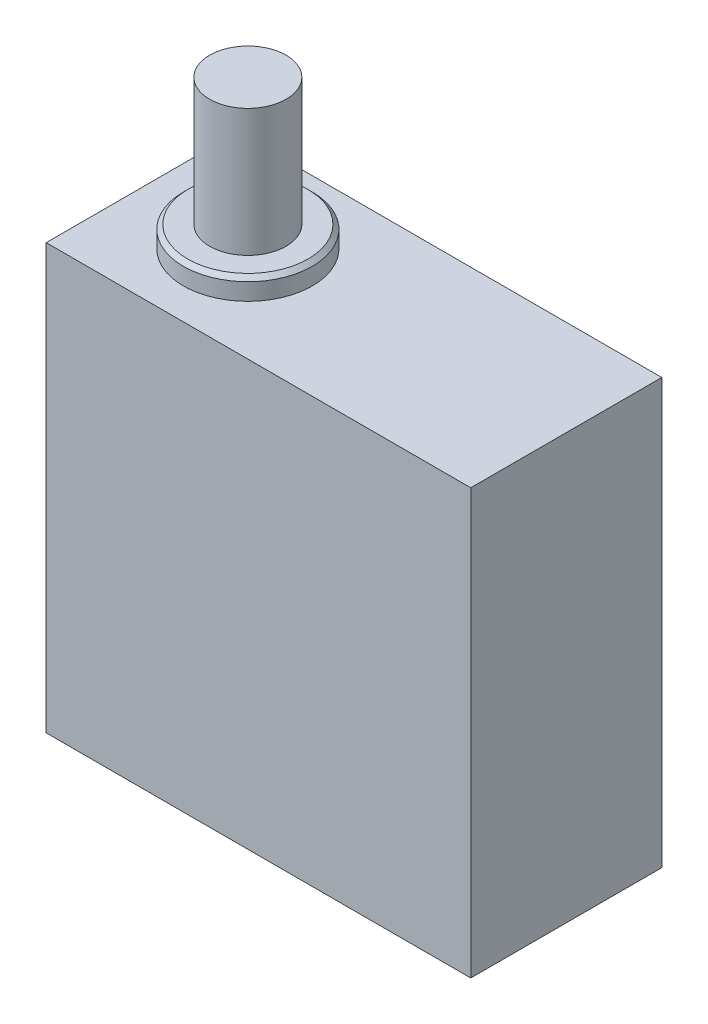
ISO-10303-21;
HEADER;
FILE_DESCRIPTION(('STEP AP214'),'2;1');
FILE_NAME('part.step','',(''),(''),'','','');
FILE_SCHEMA(('AUTOMOTIVE_DESIGN { 1 0 10303 214 1 1 1 1 }'));
ENDSEC;
DATA;
#1=APPLICATION_CONTEXT('core data for automotive mechanical design processes');
#2=APPLICATION_PROTOCOL_DEFINITION('international standard','automotive_design',2000,#1);
#3=PRODUCT_CONTEXT('',#1,'mechanical');
#4=PRODUCT('Part','Part','',(#3));
#5=PRODUCT_RELATED_PRODUCT_CATEGORY('part','',(#4));
#6=PRODUCT_DEFINITION_FORMATION('','',#4);
#7=PRODUCT_DEFINITION_CONTEXT('part definition',#1,'design');
#8=PRODUCT_DEFINITION('design','',#6,#7);
#9=PRODUCT_DEFINITION_SHAPE('','',#8);
#10=(LENGTH_UNIT() NAMED_UNIT(*) SI_UNIT(.MILLI.,.METRE.));
#11=(NAMED_UNIT(*) PLANE_ANGLE_UNIT() SI_UNIT($,.RADIAN.));
#12=(NAMED_UNIT(*) SI_UNIT($,.STERADIAN.) SOLID_ANGLE_UNIT());
#13=UNCERTAINTY_MEASURE_WITH_UNIT(LENGTH_MEASURE(1.E-05),#10,'distance_accuracy_value','');
#14=(GEOMETRIC_REPRESENTATION_CONTEXT(3) GLOBAL_UNCERTAINTY_ASSIGNED_CONTEXT((#13)) GLOBAL_UNIT_ASSIGNED_CONTEXT((#10,
#11,#12)) REPRESENTATION_CONTEXT('',''));
#15=CARTESIAN_POINT('',(0.,0.,0.));
#16=DIRECTION('',(0.,0.,1.));
#17=DIRECTION('',(1.,0.,0.));
#18=AXIS2_PLACEMENT_3D('',#15,#16,#17);
#19=CARTESIAN_POINT('',(0.,0.,9.));
#20=DIRECTION('',(1.,0.,0.));
#21=DIRECTION('',(0.,0.,-1.));
#22=AXIS2_PLACEMENT_3D('',#19,#20,#21);
#23=PLANE('',#22);
#24=DIRECTION('',(0.,-1.,0.));
#25=VECTOR('',#24,1.);
#26=CARTESIAN_POINT('',(0.,0.,0.));
#27=LINE('',#26,#25);
#28=CARTESIAN_POINT('',(0.,20.,0.));
#29=VERTEX_POINT('',#28);
#30=CARTESIAN_POINT('',(0.,0.,0.));
#31=VERTEX_POINT('',#30);
#32=EDGE_CURVE('E105',#29,#31,#27,.T.);
#33=ORIENTED_EDGE('',*,*,#32,.T.);
#34=DIRECTION('',(0.,0.,-1.));
#35=VECTOR('',#34,1.);
#36=CARTESIAN_POINT('',(0.,0.,9.));
#37=LINE('',#36,#35);
#38=CARTESIAN_POINT('',(0.,0.,9.));
#39=VERTEX_POINT('',#38);
#40=EDGE_CURVE('E96',#39,#31,#37,.T.);
#41=ORIENTED_EDGE('',*,*,#40,.F.);
#42=DIRECTION('',(0.,-1.,0.));
#43=VECTOR('',#42,1.);
#44=CARTESIAN_POINT('',(0.,0.,9.));
#45=LINE('',#44,#43);
#46=CARTESIAN_POINT('',(0.,20.,9.));
#47=VERTEX_POINT('',#46);
#48=EDGE_CURVE('E90',#47,#39,#45,.T.);
#49=ORIENTED_EDGE('',*,*,#48,.F.);
#50=DIRECTION('',(0.,0.,-1.));
#51=VECTOR('',#50,1.);
#52=CARTESIAN_POINT('',(0.,20.,9.));
#53=LINE('',#52,#51);
#54=EDGE_CURVE('E101',#47,#29,#53,.T.);
#55=ORIENTED_EDGE('',*,*,#54,.T.);
#56=EDGE_LOOP('',(#33,#41,#49,#55));
#57=FACE_BOUND('',#56,.T.);
#58=ADVANCED_FACE('F36',(#57),#23,.F.);
#59=CARTESIAN_POINT('',(0.,0.,9.));
#60=DIRECTION('',(0.,1.,0.));
#61=DIRECTION('',(0.,0.,1.));
#62=AXIS2_PLACEMENT_3D('',#59,#60,#61);
#63=PLANE('',#62);
#64=DIRECTION('',(1.,0.,0.));
#65=VECTOR('',#64,1.);
#66=CARTESIAN_POINT('',(0.,0.,0.));
#67=LINE('',#66,#65);
#68=CARTESIAN_POINT('',(20.,0.,0.));
#69=VERTEX_POINT('',#68);
#70=EDGE_CURVE('E95',#31,#69,#67,.T.);
#71=ORIENTED_EDGE('',*,*,#70,.T.);
#72=DIRECTION('',(0.,0.,-1.));
#73=VECTOR('',#72,1.);
#74=CARTESIAN_POINT('',(20.,0.,9.));
#75=LINE('',#74,#73);
#76=CARTESIAN_POINT('',(20.,0.,9.));
#77=VERTEX_POINT('',#76);
#78=EDGE_CURVE('E93',#77,#69,#75,.T.);
#79=ORIENTED_EDGE('',*,*,#78,.F.);
#80=DIRECTION('',(1.,0.,0.));
#81=VECTOR('',#80,1.);
#82=CARTESIAN_POINT('',(0.,0.,9.));
#83=LINE('',#82,#81);
#84=EDGE_CURVE('E85',#39,#77,#83,.T.);
#85=ORIENTED_EDGE('',*,*,#84,.F.);
#86=ORIENTED_EDGE('',*,*,#40,.T.);
#87=EDGE_LOOP('',(#71,#79,#85,#86));
#88=FACE_BOUND('',#87,.T.);
#89=ADVANCED_FACE('F94',(#88),#63,.F.);
#90=CARTESIAN_POINT('',(20.,0.,9.));
#91=DIRECTION('',(-1.,0.,0.));
#92=DIRECTION('',(0.,0.,1.));
#93=AXIS2_PLACEMENT_3D('',#90,#91,#92);
#94=PLANE('',#93);
#95=DIRECTION('',(0.,1.,0.));
#96=VECTOR('',#95,1.);
#97=CARTESIAN_POINT('',(20.,0.,0.));
#98=LINE('',#97,#96);
#99=CARTESIAN_POINT('',(20.,20.,0.));
#100=VERTEX_POINT('',#99);
#101=EDGE_CURVE('E71',#69,#100,#98,.T.);
#102=ORIENTED_EDGE('',*,*,#101,.T.);
#103=DIRECTION('',(0.,0.,-1.));
#104=VECTOR('',#103,1.);
#105=CARTESIAN_POINT('',(20.,20.,9.));
#106=LINE('',#105,#104);
#107=CARTESIAN_POINT('',(20.,20.,9.));
#108=VERTEX_POINT('',#107);
#109=EDGE_CURVE('E97',#108,#100,#106,.T.);
#110=ORIENTED_EDGE('',*,*,#109,.F.);
#111=DIRECTION('',(0.,1.,0.));
#112=VECTOR('',#111,1.);
#113=CARTESIAN_POINT('',(20.,0.,9.));
#114=LINE('',#113,#112);
#115=EDGE_CURVE('E88',#77,#108,#114,.T.);
#116=ORIENTED_EDGE('',*,*,#115,.F.);
#117=ORIENTED_EDGE('',*,*,#78,.T.);
#118=EDGE_LOOP('',(#102,#110,#116,#117));
#119=FACE_BOUND('',#118,.T.);
#120=ADVANCED_FACE('F99',(#119),#94,.F.);
#121=CARTESIAN_POINT('',(0.,20.,9.));
#122=DIRECTION('',(0.,-1.,0.));
#123=DIRECTION('',(0.,0.,-1.));
#124=AXIS2_PLACEMENT_3D('',#121,#122,#123);
#125=PLANE('',#124);
#126=CARTESIAN_POINT('',(5.,20.,4.5));
#127=DIRECTION('',(0.,-1.,0.));
#128=DIRECTION('',(0.,0.,-1.));
#129=AXIS2_PLACEMENT_3D('',#126,#127,#128);
#130=CIRCLE('',#129,3.03524688097145);
#131=CARTESIAN_POINT('',(5.,20.,1.46475311902855));
#132=VERTEX_POINT('',#131);
#133=EDGE_CURVE('E115',#132,#132,#130,.F.);
#134=ORIENTED_EDGE('',*,*,#133,.F.);
#135=EDGE_LOOP('',(#134));
#136=FACE_BOUND('',#135,.T.);
#137=DIRECTION('',(-1.,0.,0.));
#138=VECTOR('',#137,1.);
#139=CARTESIAN_POINT('',(0.,20.,0.));
#140=LINE('',#139,#138);
#141=EDGE_CURVE('E77',#100,#29,#140,.T.);
#142=ORIENTED_EDGE('',*,*,#141,.T.);
#143=ORIENTED_EDGE('',*,*,#54,.F.);
#144=DIRECTION('',(-1.,0.,0.));
#145=VECTOR('',#144,1.);
#146=CARTESIAN_POINT('',(0.,20.,9.));
#147=LINE('',#146,#145);
#148=EDGE_CURVE('E54',#108,#47,#147,.T.);
#149=ORIENTED_EDGE('',*,*,#148,.F.);
#150=ORIENTED_EDGE('',*,*,#109,.T.);
#151=EDGE_LOOP('',(#142,#143,#149,#150));
#152=FACE_BOUND('',#151,.T.);
#153=ADVANCED_FACE('F149',(#136,#152),#125,.F.);
#154=CARTESIAN_POINT('',(0.,0.,9.));
#155=DIRECTION('',(0.,0.,-1.));
#156=DIRECTION('',(-1.,0.,0.));
#157=AXIS2_PLACEMENT_3D('',#154,#155,#156);
#158=PLANE('',#157);
#159=ORIENTED_EDGE('',*,*,#48,.T.);
#160=ORIENTED_EDGE('',*,*,#84,.T.);
#161=ORIENTED_EDGE('',*,*,#115,.T.);
#162=ORIENTED_EDGE('',*,*,#148,.T.);
#163=EDGE_LOOP('',(#159,#160,#161,#162));
#164=FACE_BOUND('',#163,.T.);
#165=ADVANCED_FACE('F86',(#164),#158,.F.);
#166=CARTESIAN_POINT('',(0.,0.,0.));
#167=DIRECTION('',(0.,0.,-1.));
#168=DIRECTION('',(-1.,0.,0.));
#169=AXIS2_PLACEMENT_3D('',#166,#167,#168);
#170=PLANE('',#169);
#171=ORIENTED_EDGE('',*,*,#32,.F.);
#172=ORIENTED_EDGE('',*,*,#141,.F.);
#173=ORIENTED_EDGE('',*,*,#101,.F.);
#174=ORIENTED_EDGE('',*,*,#70,.F.);
#175=EDGE_LOOP('',(#171,#172,#173,#174));
#176=FACE_BOUND('',#175,.T.);
#177=ADVANCED_FACE('F153',(#176),#170,.T.);
#178=CARTESIAN_POINT('',(5.,21.,4.5));
#179=DIRECTION('',(0.,-1.,0.));
#180=DIRECTION('',(0.,0.,-1.));
#181=AXIS2_PLACEMENT_3D('',#178,#179,#180);
#182=CYLINDRICAL_SURFACE('',#181,3.03524688097145);
#183=CARTESIAN_POINT('',(5.,20.8,4.5));
#184=DIRECTION('',(0.,1.,0.));
#185=DIRECTION('',(0.,0.,1.));
#186=AXIS2_PLACEMENT_3D('',#183,#184,#185);
#187=CIRCLE('',#186,3.03524688097145);
#188=CARTESIAN_POINT('',(5.,20.8,7.53524688097145));
#189=VERTEX_POINT('',#188);
#190=EDGE_CURVE('E40',#189,#189,#187,.F.);
#191=ORIENTED_EDGE('',*,*,#190,.T.);
#192=EDGE_LOOP('',(#191));
#193=FACE_BOUND('',#192,.T.);
#194=ORIENTED_EDGE('',*,*,#133,.T.);
#195=EDGE_LOOP('',(#194));
#196=FACE_BOUND('',#195,.T.);
#197=ADVANCED_FACE('F124',(#193,#196),#182,.T.);
#198=CARTESIAN_POINT('',(0.,21.,0.));
#199=DIRECTION('',(0.,1.,0.));
#200=DIRECTION('',(0.,0.,1.));
#201=AXIS2_PLACEMENT_3D('',#198,#199,#200);
#202=PLANE('',#201);
#203=CARTESIAN_POINT('',(5.,21.,4.5));
#204=DIRECTION('',(0.,1.,0.));
#205=DIRECTION('',(0.,0.,1.));
#206=AXIS2_PLACEMENT_3D('',#203,#204,#205);
#207=CIRCLE('',#206,1.8);
#208=CARTESIAN_POINT('',(5.,21.,6.3));
#209=VERTEX_POINT('',#208);
#210=EDGE_CURVE('E11',#209,#209,#207,.T.);
#211=ORIENTED_EDGE('',*,*,#210,.F.);
#212=EDGE_LOOP('',(#211));
#213=FACE_BOUND('',#212,.T.);
#214=CARTESIAN_POINT('',(5.,21.,4.5));
#215=DIRECTION('',(0.,1.,0.));
#216=DIRECTION('',(0.,0.,1.));
#217=AXIS2_PLACEMENT_3D('',#214,#215,#216);
#218=CIRCLE('',#217,2.83524688097145);
#219=CARTESIAN_POINT('',(5.,21.,7.33524688097145));
#220=VERTEX_POINT('',#219);
#221=EDGE_CURVE('E117',#220,#220,#218,.T.);
#222=ORIENTED_EDGE('',*,*,#221,.T.);
#223=EDGE_LOOP('',(#222));
#224=FACE_BOUND('',#223,.T.);
#225=ADVANCED_FACE('F130',(#213,#224),#202,.T.);
#226=CARTESIAN_POINT('',(5.,21.,4.5));
#227=DIRECTION('',(0.,-1.,0.));
#228=DIRECTION('',(0.,0.,-1.));
#229=AXIS2_PLACEMENT_3D('',#226,#227,#228);
#230=CONICAL_SURFACE('',#229,2.83524688097145,0.785398163397442);
#231=ORIENTED_EDGE('',*,*,#190,.F.);
#232=EDGE_LOOP('',(#231));
#233=FACE_BOUND('',#232,.T.);
#234=ORIENTED_EDGE('',*,*,#221,.F.);
#235=EDGE_LOOP('',(#234));
#236=FACE_BOUND('',#235,.T.);
#237=ADVANCED_FACE('F38',(#233,#236),#230,.T.);
#238=CARTESIAN_POINT('',(5.,27.,4.5));
#239=DIRECTION('',(0.,-1.,0.));
#240=DIRECTION('',(0.,0.,-1.));
#241=AXIS2_PLACEMENT_3D('',#238,#239,#240);
#242=CYLINDRICAL_SURFACE('',#241,1.8);
#243=CARTESIAN_POINT('',(5.,27.,4.5));
#244=DIRECTION('',(0.,1.,0.));
#245=DIRECTION('',(0.,0.,1.));
#246=AXIS2_PLACEMENT_3D('',#243,#244,#245);
#247=CIRCLE('',#246,1.8);
#248=CARTESIAN_POINT('',(5.,27.,6.3));
#249=VERTEX_POINT('',#248);
#250=EDGE_CURVE('E108',#249,#249,#247,.T.);
#251=ORIENTED_EDGE('',*,*,#250,.F.);
#252=EDGE_LOOP('',(#251));
#253=FACE_BOUND('',#252,.T.);
#254=ORIENTED_EDGE('',*,*,#210,.T.);
#255=EDGE_LOOP('',(#254));
#256=FACE_BOUND('',#255,.T.);
#257=ADVANCED_FACE('F129',(#253,#256),#242,.T.);
#258=CARTESIAN_POINT('',(5.,27.,4.5));
#259=DIRECTION('',(0.,1.,0.));
#260=DIRECTION('',(0.,0.,1.));
#261=AXIS2_PLACEMENT_3D('',#258,#259,#260);
#262=PLANE('',#261);
#263=ORIENTED_EDGE('',*,*,#250,.T.);
#264=EDGE_LOOP('',(#263));
#265=FACE_BOUND('',#264,.T.);
#266=ADVANCED_FACE('F135',(#265),#262,.T.);
#267=CLOSED_SHELL('',(#58,#89,#120,#153,#165,#177,#197,#225,#237,#257,#266));
#268=MANIFOLD_SOLID_BREP('B2',#267);
#269=ADVANCED_BREP_SHAPE_REPRESENTATION('',(#18,#268),#14);
#270=SHAPE_DEFINITION_REPRESENTATION(#9,#269);
ENDSEC;
END-ISO-10303-21;
